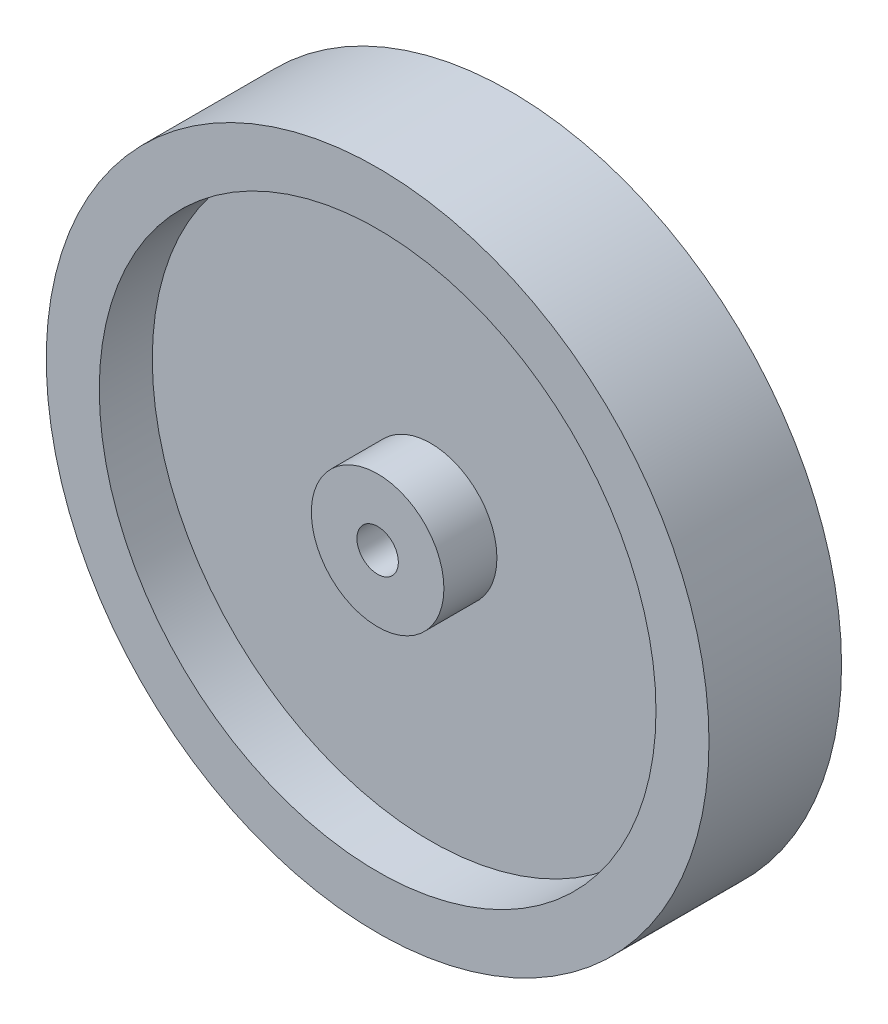
ISO-10303-21;
HEADER;
FILE_DESCRIPTION(('STEP AP214'),'2;1');
FILE_NAME('part.step','',(''),(''),'','','');
FILE_SCHEMA(('AUTOMOTIVE_DESIGN { 1 0 10303 214 1 1 1 1 }'));
ENDSEC;
DATA;
#1=APPLICATION_CONTEXT('core data for automotive mechanical design processes');
#2=APPLICATION_PROTOCOL_DEFINITION('international standard','automotive_design',2000,#1);
#3=PRODUCT_CONTEXT('',#1,'mechanical');
#4=PRODUCT('Part','Part','',(#3));
#5=PRODUCT_RELATED_PRODUCT_CATEGORY('part','',(#4));
#6=PRODUCT_DEFINITION_FORMATION('','',#4);
#7=PRODUCT_DEFINITION_CONTEXT('part definition',#1,'design');
#8=PRODUCT_DEFINITION('design','',#6,#7);
#9=PRODUCT_DEFINITION_SHAPE('','',#8);
#10=(LENGTH_UNIT() NAMED_UNIT(*) SI_UNIT(.MILLI.,.METRE.));
#11=(NAMED_UNIT(*) PLANE_ANGLE_UNIT() SI_UNIT($,.RADIAN.));
#12=(NAMED_UNIT(*) SI_UNIT($,.STERADIAN.) SOLID_ANGLE_UNIT());
#13=UNCERTAINTY_MEASURE_WITH_UNIT(LENGTH_MEASURE(1.E-05),#10,'distance_accuracy_value','');
#14=(GEOMETRIC_REPRESENTATION_CONTEXT(3) GLOBAL_UNCERTAINTY_ASSIGNED_CONTEXT((#13)) GLOBAL_UNIT_ASSIGNED_CONTEXT((#10,
#11,#12)) REPRESENTATION_CONTEXT('',''));
#15=CARTESIAN_POINT('',(0.,0.,0.));
#16=DIRECTION('',(0.,0.,1.));
#17=DIRECTION('',(1.,0.,0.));
#18=AXIS2_PLACEMENT_3D('',#15,#16,#17);
#19=CARTESIAN_POINT('',(0.,0.,-12.7));
#20=DIRECTION('',(0.,0.,1.));
#21=DIRECTION('',(1.,0.,0.));
#22=AXIS2_PLACEMENT_3D('',#19,#20,#21);
#23=PLANE('',#22);
#24=CARTESIAN_POINT('',(0.,0.,-12.7));
#25=DIRECTION('',(0.,0.,1.));
#26=DIRECTION('',(1.,0.,0.));
#27=AXIS2_PLACEMENT_3D('',#24,#25,#26);
#28=CIRCLE('',#27,3.96875);
#29=CARTESIAN_POINT('',(3.96875,0.,-12.7));
#30=VERTEX_POINT('',#29);
#31=EDGE_CURVE('E62',#30,#30,#28,.T.);
#32=ORIENTED_EDGE('',*,*,#31,.T.);
#33=EDGE_LOOP('',(#32));
#34=FACE_BOUND('',#33,.T.);
#35=CARTESIAN_POINT('',(0.,0.,-12.7));
#36=DIRECTION('',(0.,0.,1.));
#37=DIRECTION('',(1.,0.,0.));
#38=AXIS2_PLACEMENT_3D('',#35,#36,#37);
#39=CIRCLE('',#38,12.7);
#40=CARTESIAN_POINT('',(12.7,0.,-12.7));
#41=VERTEX_POINT('',#40);
#42=EDGE_CURVE('E88',#41,#41,#39,.T.);
#43=ORIENTED_EDGE('',*,*,#42,.F.);
#44=EDGE_LOOP('',(#43));
#45=FACE_BOUND('',#44,.T.);
#46=ADVANCED_FACE('F51',(#34,#45),#23,.F.);
#47=CARTESIAN_POINT('',(0.,0.,12.7));
#48=DIRECTION('',(0.,0.,1.));
#49=DIRECTION('',(1.,0.,0.));
#50=AXIS2_PLACEMENT_3D('',#47,#48,#49);
#51=PLANE('',#50);
#52=CARTESIAN_POINT('',(0.,0.,12.7));
#53=DIRECTION('',(0.,0.,1.));
#54=DIRECTION('',(1.,0.,0.));
#55=AXIS2_PLACEMENT_3D('',#52,#53,#54);
#56=CIRCLE('',#55,3.96875);
#57=CARTESIAN_POINT('',(3.96875,0.,12.7));
#58=VERTEX_POINT('',#57);
#59=EDGE_CURVE('E64',#58,#58,#56,.T.);
#60=ORIENTED_EDGE('',*,*,#59,.F.);
#61=EDGE_LOOP('',(#60));
#62=FACE_BOUND('',#61,.T.);
#63=CARTESIAN_POINT('',(0.,0.,12.7));
#64=DIRECTION('',(0.,0.,1.));
#65=DIRECTION('',(1.,0.,0.));
#66=AXIS2_PLACEMENT_3D('',#63,#64,#65);
#67=CIRCLE('',#66,12.7);
#68=CARTESIAN_POINT('',(12.7,0.,12.7));
#69=VERTEX_POINT('',#68);
#70=EDGE_CURVE('E76',#69,#69,#67,.T.);
#71=ORIENTED_EDGE('',*,*,#70,.T.);
#72=EDGE_LOOP('',(#71));
#73=FACE_BOUND('',#72,.T.);
#74=ADVANCED_FACE('F104',(#62,#73),#51,.T.);
#75=CARTESIAN_POINT('',(0.,0.,-12.7));
#76=DIRECTION('',(0.,0.,1.));
#77=DIRECTION('',(1.,0.,0.));
#78=AXIS2_PLACEMENT_3D('',#75,#76,#77);
#79=CYLINDRICAL_SURFACE('',#78,63.5);
#80=CARTESIAN_POINT('',(0.,0.,-12.7));
#81=DIRECTION('',(0.,0.,1.));
#82=DIRECTION('',(1.,0.,0.));
#83=AXIS2_PLACEMENT_3D('',#80,#81,#82);
#84=CIRCLE('',#83,63.5);
#85=CARTESIAN_POINT('',(63.5,0.,-12.7));
#86=VERTEX_POINT('',#85);
#87=EDGE_CURVE('E12',#86,#86,#84,.T.);
#88=ORIENTED_EDGE('',*,*,#87,.T.);
#89=EDGE_LOOP('',(#88));
#90=FACE_BOUND('',#89,.T.);
#91=CARTESIAN_POINT('',(0.,0.,12.7));
#92=DIRECTION('',(0.,0.,1.));
#93=DIRECTION('',(1.,0.,0.));
#94=AXIS2_PLACEMENT_3D('',#91,#92,#93);
#95=CIRCLE('',#94,63.5);
#96=CARTESIAN_POINT('',(63.5,0.,12.7));
#97=VERTEX_POINT('',#96);
#98=EDGE_CURVE('E55',#97,#97,#95,.T.);
#99=ORIENTED_EDGE('',*,*,#98,.F.);
#100=EDGE_LOOP('',(#99));
#101=FACE_BOUND('',#100,.T.);
#102=ADVANCED_FACE('F53',(#90,#101),#79,.T.);
#103=CARTESIAN_POINT('',(0.,0.,-12.7));
#104=DIRECTION('',(0.,0.,1.));
#105=DIRECTION('',(1.,0.,0.));
#106=AXIS2_PLACEMENT_3D('',#103,#104,#105);
#107=CIRCLE('',#106,53.34);
#108=CARTESIAN_POINT('',(53.34,0.,-12.7));
#109=VERTEX_POINT('',#108);
#110=EDGE_CURVE('E82',#109,#109,#107,.T.);
#111=ORIENTED_EDGE('',*,*,#110,.T.);
#112=EDGE_LOOP('',(#111));
#113=FACE_BOUND('',#112,.T.);
#114=ORIENTED_EDGE('',*,*,#87,.F.);
#115=EDGE_LOOP('',(#114));
#116=FACE_BOUND('',#115,.T.);
#117=ADVANCED_FACE('F107',(#113,#116),#23,.F.);
#118=CARTESIAN_POINT('',(0.,0.,12.7));
#119=DIRECTION('',(0.,0.,1.));
#120=DIRECTION('',(1.,0.,0.));
#121=AXIS2_PLACEMENT_3D('',#118,#119,#120);
#122=CIRCLE('',#121,53.34);
#123=CARTESIAN_POINT('',(53.34,0.,12.7));
#124=VERTEX_POINT('',#123);
#125=EDGE_CURVE('E70',#124,#124,#122,.T.);
#126=ORIENTED_EDGE('',*,*,#125,.F.);
#127=EDGE_LOOP('',(#126));
#128=FACE_BOUND('',#127,.T.);
#129=ORIENTED_EDGE('',*,*,#98,.T.);
#130=EDGE_LOOP('',(#129));
#131=FACE_BOUND('',#130,.T.);
#132=ADVANCED_FACE('F112',(#128,#131),#51,.T.);
#133=CARTESIAN_POINT('',(0.,0.,-12.7));
#134=DIRECTION('',(0.,0.,1.));
#135=DIRECTION('',(1.,0.,0.));
#136=AXIS2_PLACEMENT_3D('',#133,#134,#135);
#137=CYLINDRICAL_SURFACE('',#136,3.96875);
#138=ORIENTED_EDGE('',*,*,#31,.F.);
#139=EDGE_LOOP('',(#138));
#140=FACE_BOUND('',#139,.T.);
#141=ORIENTED_EDGE('',*,*,#59,.T.);
#142=EDGE_LOOP('',(#141));
#143=FACE_BOUND('',#142,.T.);
#144=ADVANCED_FACE('F120',(#140,#143),#137,.F.);
#145=CARTESIAN_POINT('',(0.,0.,2.53999999999999));
#146=DIRECTION('',(0.,0.,1.));
#147=DIRECTION('',(1.,0.,0.));
#148=AXIS2_PLACEMENT_3D('',#145,#146,#147);
#149=CYLINDRICAL_SURFACE('',#148,53.34);
#150=CARTESIAN_POINT('',(0.,0.,2.53999999999999));
#151=DIRECTION('',(0.,0.,1.));
#152=DIRECTION('',(1.,0.,0.));
#153=AXIS2_PLACEMENT_3D('',#150,#151,#152);
#154=CIRCLE('',#153,53.34);
#155=CARTESIAN_POINT('',(53.34,0.,2.53999999999999));
#156=VERTEX_POINT('',#155);
#157=EDGE_CURVE('E67',#156,#156,#154,.T.);
#158=ORIENTED_EDGE('',*,*,#157,.F.);
#159=EDGE_LOOP('',(#158));
#160=FACE_BOUND('',#159,.T.);
#161=ORIENTED_EDGE('',*,*,#125,.T.);
#162=EDGE_LOOP('',(#161));
#163=FACE_BOUND('',#162,.T.);
#164=ADVANCED_FACE('F141',(#160,#163),#149,.F.);
#165=CARTESIAN_POINT('',(0.,0.,2.53999999999999));
#166=DIRECTION('',(0.,0.,1.));
#167=DIRECTION('',(1.,0.,0.));
#168=AXIS2_PLACEMENT_3D('',#165,#166,#167);
#169=PLANE('',#168);
#170=CARTESIAN_POINT('',(0.,0.,2.53999999999999));
#171=DIRECTION('',(0.,0.,1.));
#172=DIRECTION('',(1.,0.,0.));
#173=AXIS2_PLACEMENT_3D('',#170,#171,#172);
#174=CIRCLE('',#173,12.7);
#175=CARTESIAN_POINT('',(12.7,0.,2.53999999999999));
#176=VERTEX_POINT('',#175);
#177=EDGE_CURVE('E73',#176,#176,#174,.T.);
#178=ORIENTED_EDGE('',*,*,#177,.F.);
#179=EDGE_LOOP('',(#178));
#180=FACE_BOUND('',#179,.T.);
#181=ORIENTED_EDGE('',*,*,#157,.T.);
#182=EDGE_LOOP('',(#181));
#183=FACE_BOUND('',#182,.T.);
#184=ADVANCED_FACE('F137',(#180,#183),#169,.T.);
#185=CARTESIAN_POINT('',(0.,0.,2.53999999999999));
#186=DIRECTION('',(0.,0.,1.));
#187=DIRECTION('',(1.,0.,0.));
#188=AXIS2_PLACEMENT_3D('',#185,#186,#187);
#189=CYLINDRICAL_SURFACE('',#188,12.7);
#190=ORIENTED_EDGE('',*,*,#177,.T.);
#191=EDGE_LOOP('',(#190));
#192=FACE_BOUND('',#191,.T.);
#193=ORIENTED_EDGE('',*,*,#70,.F.);
#194=EDGE_LOOP('',(#193));
#195=FACE_BOUND('',#194,.T.);
#196=ADVANCED_FACE('F131',(#192,#195),#189,.T.);
#197=CARTESIAN_POINT('',(0.,0.,-2.53999999999999));
#198=DIRECTION('',(0.,0.,-1.));
#199=DIRECTION('',(1.,0.,0.));
#200=AXIS2_PLACEMENT_3D('',#197,#198,#199);
#201=PLANE('',#200);
#202=CARTESIAN_POINT('',(0.,0.,-2.53999999999999));
#203=DIRECTION('',(0.,0.,1.));
#204=DIRECTION('',(1.,0.,0.));
#205=AXIS2_PLACEMENT_3D('',#202,#203,#204);
#206=CIRCLE('',#205,53.34);
#207=CARTESIAN_POINT('',(53.34,0.,-2.53999999999999));
#208=VERTEX_POINT('',#207);
#209=EDGE_CURVE('E79',#208,#208,#206,.T.);
#210=ORIENTED_EDGE('',*,*,#209,.F.);
#211=EDGE_LOOP('',(#210));
#212=FACE_BOUND('',#211,.T.);
#213=CARTESIAN_POINT('',(0.,0.,-2.53999999999999));
#214=DIRECTION('',(0.,0.,1.));
#215=DIRECTION('',(1.,0.,0.));
#216=AXIS2_PLACEMENT_3D('',#213,#214,#215);
#217=CIRCLE('',#216,12.7);
#218=CARTESIAN_POINT('',(12.7,0.,-2.53999999999999));
#219=VERTEX_POINT('',#218);
#220=EDGE_CURVE('E85',#219,#219,#217,.T.);
#221=ORIENTED_EDGE('',*,*,#220,.T.);
#222=EDGE_LOOP('',(#221));
#223=FACE_BOUND('',#222,.T.);
#224=ADVANCED_FACE('F94',(#212,#223),#201,.T.);
#225=CARTESIAN_POINT('',(0.,0.,-2.53999999999999));
#226=DIRECTION('',(0.,0.,-1.));
#227=DIRECTION('',(-1.,0.,0.));
#228=AXIS2_PLACEMENT_3D('',#225,#226,#227);
#229=CYLINDRICAL_SURFACE('',#228,53.34);
#230=ORIENTED_EDGE('',*,*,#209,.T.);
#231=EDGE_LOOP('',(#230));
#232=FACE_BOUND('',#231,.T.);
#233=ORIENTED_EDGE('',*,*,#110,.F.);
#234=EDGE_LOOP('',(#233));
#235=FACE_BOUND('',#234,.T.);
#236=ADVANCED_FACE('F99',(#232,#235),#229,.F.);
#237=CARTESIAN_POINT('',(0.,0.,-2.53999999999999));
#238=DIRECTION('',(0.,0.,-1.));
#239=DIRECTION('',(-1.,0.,0.));
#240=AXIS2_PLACEMENT_3D('',#237,#238,#239);
#241=CYLINDRICAL_SURFACE('',#240,12.7);
#242=ORIENTED_EDGE('',*,*,#220,.F.);
#243=EDGE_LOOP('',(#242));
#244=FACE_BOUND('',#243,.T.);
#245=ORIENTED_EDGE('',*,*,#42,.T.);
#246=EDGE_LOOP('',(#245));
#247=FACE_BOUND('',#246,.T.);
#248=ADVANCED_FACE('F96',(#244,#247),#241,.T.);
#249=CLOSED_SHELL('',(#46,#74,#102,#117,#132,#144,#164,#184,#196,#224,#236,#248));
#250=MANIFOLD_SOLID_BREP('B2',#249);
#251=ADVANCED_BREP_SHAPE_REPRESENTATION('',(#18,#250),#14);
#252=SHAPE_DEFINITION_REPRESENTATION(#9,#251);
ENDSEC;
END-ISO-10303-21;
